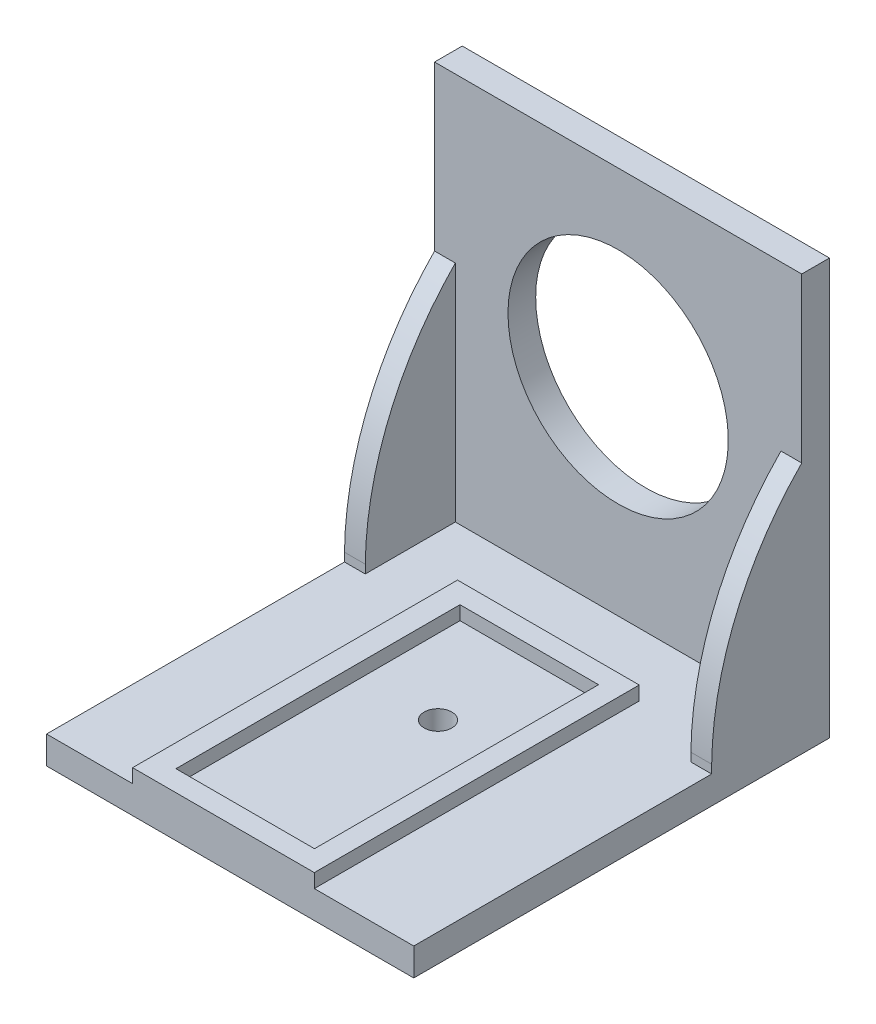
ISO-10303-21;
HEADER;
FILE_DESCRIPTION(('STEP AP214'),'2;1');
FILE_NAME('part.step','',(''),(''),'','','');
FILE_SCHEMA(('AUTOMOTIVE_DESIGN { 1 0 10303 214 1 1 1 1 }'));
ENDSEC;
DATA;
#1=APPLICATION_CONTEXT('core data for automotive mechanical design processes');
#2=APPLICATION_PROTOCOL_DEFINITION('international standard','automotive_design',2000,#1);
#3=PRODUCT_CONTEXT('',#1,'mechanical');
#4=PRODUCT('Part','Part','',(#3));
#5=PRODUCT_RELATED_PRODUCT_CATEGORY('part','',(#4));
#6=PRODUCT_DEFINITION_FORMATION('','',#4);
#7=PRODUCT_DEFINITION_CONTEXT('part definition',#1,'design');
#8=PRODUCT_DEFINITION('design','',#6,#7);
#9=PRODUCT_DEFINITION_SHAPE('','',#8);
#10=(LENGTH_UNIT() NAMED_UNIT(*) SI_UNIT(.MILLI.,.METRE.));
#11=(NAMED_UNIT(*) PLANE_ANGLE_UNIT() SI_UNIT($,.RADIAN.));
#12=(NAMED_UNIT(*) SI_UNIT($,.STERADIAN.) SOLID_ANGLE_UNIT());
#13=UNCERTAINTY_MEASURE_WITH_UNIT(LENGTH_MEASURE(1.E-05),#10,'distance_accuracy_value','');
#14=(GEOMETRIC_REPRESENTATION_CONTEXT(3) GLOBAL_UNCERTAINTY_ASSIGNED_CONTEXT((#13)) GLOBAL_UNIT_ASSIGNED_CONTEXT((#10,
#11,#12)) REPRESENTATION_CONTEXT('',''));
#15=CARTESIAN_POINT('',(0.,0.,0.));
#16=DIRECTION('',(0.,0.,1.));
#17=DIRECTION('',(1.,0.,0.));
#18=AXIS2_PLACEMENT_3D('',#15,#16,#17);
#19=CARTESIAN_POINT('',(0.,4.,60.));
#20=DIRECTION('',(0.,-1.,0.));
#21=DIRECTION('',(0.,0.,-1.));
#22=AXIS2_PLACEMENT_3D('',#19,#20,#21);
#23=PLANE('',#22);
#24=DIRECTION('',(0.,0.,-1.));
#25=VECTOR('',#24,1.);
#26=CARTESIAN_POINT('',(38.6461164607933,4.,60.));
#27=LINE('',#26,#25);
#28=CARTESIAN_POINT('',(38.6461164607933,4.,60.));
#29=VERTEX_POINT('',#28);
#30=CARTESIAN_POINT('',(38.6461164607933,4.,13.1010553588965));
#31=VERTEX_POINT('',#30);
#32=EDGE_CURVE('E252',#29,#31,#27,.T.);
#33=ORIENTED_EDGE('',*,*,#32,.F.);
#34=DIRECTION('',(-1.,0.,0.));
#35=VECTOR('',#34,1.);
#36=CARTESIAN_POINT('',(0.,4.,60.));
#37=LINE('',#36,#35);
#38=CARTESIAN_POINT('',(53.,4.,60.));
#39=VERTEX_POINT('',#38);
#40=EDGE_CURVE('E314',#39,#29,#37,.T.);
#41=ORIENTED_EDGE('',*,*,#40,.F.);
#42=DIRECTION('',(0.,0.,-1.));
#43=VECTOR('',#42,1.);
#44=CARTESIAN_POINT('',(53.,4.,60.));
#45=LINE('',#44,#43);
#46=CARTESIAN_POINT('',(53.,4.,17.));
#47=VERTEX_POINT('',#46);
#48=EDGE_CURVE('E320',#39,#47,#45,.T.);
#49=ORIENTED_EDGE('',*,*,#48,.T.);
#50=DIRECTION('',(1.,0.,0.));
#51=VECTOR('',#50,1.);
#52=CARTESIAN_POINT('',(0.,4.,17.));
#53=LINE('',#52,#51);
#54=CARTESIAN_POINT('',(50.,4.,17.));
#55=VERTEX_POINT('',#54);
#56=EDGE_CURVE('E293',#55,#47,#53,.T.);
#57=ORIENTED_EDGE('',*,*,#56,.F.);
#58=DIRECTION('',(0.,0.,1.));
#59=VECTOR('',#58,1.);
#60=CARTESIAN_POINT('',(50.,4.,60.));
#61=LINE('',#60,#59);
#62=CARTESIAN_POINT('',(50.,4.,4.));
#63=VERTEX_POINT('',#62);
#64=EDGE_CURVE('E287',#63,#55,#61,.T.);
#65=ORIENTED_EDGE('',*,*,#64,.F.);
#66=DIRECTION('',(-1.,0.,0.));
#67=VECTOR('',#66,1.);
#68=CARTESIAN_POINT('',(0.,4.,4.));
#69=LINE('',#68,#67);
#70=CARTESIAN_POINT('',(3.,4.,4.));
#71=VERTEX_POINT('',#70);
#72=EDGE_CURVE('E322',#63,#71,#69,.T.);
#73=ORIENTED_EDGE('',*,*,#72,.T.);
#74=DIRECTION('',(0.,0.,-1.));
#75=VECTOR('',#74,1.);
#76=CARTESIAN_POINT('',(3.,4.,60.));
#77=LINE('',#76,#75);
#78=CARTESIAN_POINT('',(3.,4.,17.));
#79=VERTEX_POINT('',#78);
#80=EDGE_CURVE('E12',#79,#71,#77,.T.);
#81=ORIENTED_EDGE('',*,*,#80,.F.);
#82=DIRECTION('',(-1.,0.,0.));
#83=VECTOR('',#82,1.);
#84=CARTESIAN_POINT('',(0.,4.,17.));
#85=LINE('',#84,#83);
#86=CARTESIAN_POINT('',(0.,4.,17.));
#87=VERTEX_POINT('',#86);
#88=EDGE_CURVE('E66',#79,#87,#85,.T.);
#89=ORIENTED_EDGE('',*,*,#88,.T.);
#90=DIRECTION('',(0.,0.,-1.));
#91=VECTOR('',#90,1.);
#92=CARTESIAN_POINT('',(0.,4.,60.));
#93=LINE('',#92,#91);
#94=CARTESIAN_POINT('',(0.,4.,60.));
#95=VERTEX_POINT('',#94);
#96=EDGE_CURVE('E317',#95,#87,#93,.T.);
#97=ORIENTED_EDGE('',*,*,#96,.F.);
#98=CARTESIAN_POINT('',(12.4175461324136,4.,60.));
#99=VERTEX_POINT('',#98);
#100=EDGE_CURVE('E313',#99,#95,#37,.T.);
#101=ORIENTED_EDGE('',*,*,#100,.F.);
#102=DIRECTION('',(0.,0.,-1.));
#103=VECTOR('',#102,1.);
#104=CARTESIAN_POINT('',(12.4175461324136,4.,60.));
#105=LINE('',#104,#103);
#106=CARTESIAN_POINT('',(12.4175461324136,4.,13.1010553588965));
#107=VERTEX_POINT('',#106);
#108=EDGE_CURVE('E249',#99,#107,#105,.T.);
#109=ORIENTED_EDGE('',*,*,#108,.T.);
#110=DIRECTION('',(1.,0.,0.));
#111=VECTOR('',#110,1.);
#112=CARTESIAN_POINT('',(0.,4.,13.1010553588965));
#113=LINE('',#112,#111);
#114=EDGE_CURVE('E262',#107,#31,#113,.T.);
#115=ORIENTED_EDGE('',*,*,#114,.T.);
#116=EDGE_LOOP('',(#33,#41,#49,#57,#65,#73,#81,#89,#97,#101,#109,#115));
#117=FACE_BOUND('',#116,.T.);
#118=ADVANCED_FACE('F57',(#117),#23,.F.);
#119=CARTESIAN_POINT('',(0.,0.,4.));
#120=DIRECTION('',(0.,0.,-1.));
#121=DIRECTION('',(-1.,0.,0.));
#122=AXIS2_PLACEMENT_3D('',#119,#120,#121);
#123=PLANE('',#122);
#124=CARTESIAN_POINT('',(26.5,33.9,4.));
#125=DIRECTION('',(0.,0.,-1.));
#126=DIRECTION('',(-1.,0.,0.));
#127=AXIS2_PLACEMENT_3D('',#124,#125,#126);
#128=CIRCLE('',#127,15.9);
#129=CARTESIAN_POINT('',(10.6,33.9,4.));
#130=VERTEX_POINT('',#129);
#131=EDGE_CURVE('E354',#130,#130,#128,.T.);
#132=ORIENTED_EDGE('',*,*,#131,.T.);
#133=EDGE_LOOP('',(#132));
#134=FACE_BOUND('',#133,.T.);
#135=DIRECTION('',(0.,-1.,0.));
#136=VECTOR('',#135,1.);
#137=CARTESIAN_POINT('',(50.,0.,4.));
#138=LINE('',#137,#136);
#139=CARTESIAN_POINT('',(50.,36.3738538523669,4.));
#140=VERTEX_POINT('',#139);
#141=EDGE_CURVE('E290',#140,#63,#138,.T.);
#142=ORIENTED_EDGE('',*,*,#141,.F.);
#143=DIRECTION('',(-1.,0.,0.));
#144=VECTOR('',#143,1.);
#145=CARTESIAN_POINT('',(0.,36.3738538523669,4.));
#146=LINE('',#145,#144);
#147=CARTESIAN_POINT('',(53.,36.3738538523669,4.));
#148=VERTEX_POINT('',#147);
#149=EDGE_CURVE('E285',#148,#140,#146,.T.);
#150=ORIENTED_EDGE('',*,*,#149,.F.);
#151=DIRECTION('',(0.,1.,0.));
#152=VECTOR('',#151,1.);
#153=CARTESIAN_POINT('',(53.,0.,4.));
#154=LINE('',#153,#152);
#155=CARTESIAN_POINT('',(53.,60.,4.));
#156=VERTEX_POINT('',#155);
#157=EDGE_CURVE('E328',#148,#156,#154,.T.);
#158=ORIENTED_EDGE('',*,*,#157,.T.);
#159=DIRECTION('',(-1.,0.,0.));
#160=VECTOR('',#159,1.);
#161=CARTESIAN_POINT('',(0.,60.,4.));
#162=LINE('',#161,#160);
#163=CARTESIAN_POINT('',(0.,60.,4.));
#164=VERTEX_POINT('',#163);
#165=EDGE_CURVE('E331',#156,#164,#162,.T.);
#166=ORIENTED_EDGE('',*,*,#165,.T.);
#167=DIRECTION('',(0.,-1.,0.));
#168=VECTOR('',#167,1.);
#169=CARTESIAN_POINT('',(0.,0.,4.));
#170=LINE('',#169,#168);
#171=CARTESIAN_POINT('',(0.,36.3738538523669,4.));
#172=VERTEX_POINT('',#171);
#173=EDGE_CURVE('E325',#164,#172,#170,.T.);
#174=ORIENTED_EDGE('',*,*,#173,.T.);
#175=DIRECTION('',(-1.,0.,0.));
#176=VECTOR('',#175,1.);
#177=CARTESIAN_POINT('',(0.,36.3738538523669,4.));
#178=LINE('',#177,#176);
#179=CARTESIAN_POINT('',(3.00000000000001,36.3738538523669,4.));
#180=VERTEX_POINT('',#179);
#181=EDGE_CURVE('E304',#180,#172,#178,.T.);
#182=ORIENTED_EDGE('',*,*,#181,.F.);
#183=DIRECTION('',(0.,1.,0.));
#184=VECTOR('',#183,1.);
#185=CARTESIAN_POINT('',(3.,0.,4.));
#186=LINE('',#185,#184);
#187=EDGE_CURVE('E301',#71,#180,#186,.T.);
#188=ORIENTED_EDGE('',*,*,#187,.F.);
#189=ORIENTED_EDGE('',*,*,#72,.F.);
#190=EDGE_LOOP('',(#142,#150,#158,#166,#174,#182,#188,#189));
#191=FACE_BOUND('',#190,.T.);
#192=ADVANCED_FACE('F390',(#134,#191),#123,.F.);
#193=CARTESIAN_POINT('',(0.,0.,4.));
#194=DIRECTION('',(1.,0.,0.));
#195=DIRECTION('',(0.,1.,0.));
#196=AXIS2_PLACEMENT_3D('',#193,#194,#195);
#197=PLANE('',#196);
#198=DIRECTION('',(0.,-1.,0.));
#199=VECTOR('',#198,1.);
#200=CARTESIAN_POINT('',(0.,36.3738538523669,17.));
#201=LINE('',#200,#199);
#202=CARTESIAN_POINT('',(0.,5.22659799611902,17.));
#203=VERTEX_POINT('',#202);
#204=EDGE_CURVE('E296',#203,#87,#201,.T.);
#205=ORIENTED_EDGE('',*,*,#204,.F.);
#206=CARTESIAN_POINT('',(0.,4.61329899805943,-28.2829503458636));
#207=DIRECTION('',(1.,0.,0.));
#208=DIRECTION('',(0.,1.,0.));
#209=AXIS2_PLACEMENT_3D('',#206,#207,#208);
#210=CIRCLE('',#209,45.2871033263);
#211=EDGE_CURVE('E277',#203,#172,#210,.F.);
#212=ORIENTED_EDGE('',*,*,#211,.T.);
#213=ORIENTED_EDGE('',*,*,#173,.F.);
#214=DIRECTION('',(0.,0.,-1.));
#215=VECTOR('',#214,1.);
#216=CARTESIAN_POINT('',(0.,60.,4.));
#217=LINE('',#216,#215);
#218=CARTESIAN_POINT('',(0.,60.,0.));
#219=VERTEX_POINT('',#218);
#220=EDGE_CURVE('E333',#164,#219,#217,.T.);
#221=ORIENTED_EDGE('',*,*,#220,.T.);
#222=DIRECTION('',(0.,-1.,0.));
#223=VECTOR('',#222,1.);
#224=CARTESIAN_POINT('',(0.,0.,0.));
#225=LINE('',#224,#223);
#226=CARTESIAN_POINT('',(0.,0.,0.));
#227=VERTEX_POINT('',#226);
#228=EDGE_CURVE('E324',#219,#227,#225,.T.);
#229=ORIENTED_EDGE('',*,*,#228,.T.);
#230=DIRECTION('',(0.,0.,-1.));
#231=VECTOR('',#230,1.);
#232=CARTESIAN_POINT('',(0.,0.,4.));
#233=LINE('',#232,#231);
#234=CARTESIAN_POINT('',(0.,0.,60.));
#235=VERTEX_POINT('',#234);
#236=EDGE_CURVE('E349',#235,#227,#233,.T.);
#237=ORIENTED_EDGE('',*,*,#236,.F.);
#238=DIRECTION('',(0.,-1.,0.));
#239=VECTOR('',#238,1.);
#240=CARTESIAN_POINT('',(0.,0.,60.));
#241=LINE('',#240,#239);
#242=EDGE_CURVE('E306',#95,#235,#241,.T.);
#243=ORIENTED_EDGE('',*,*,#242,.F.);
#244=ORIENTED_EDGE('',*,*,#96,.T.);
#245=EDGE_LOOP('',(#205,#212,#213,#221,#229,#237,#243,#244));
#246=FACE_BOUND('',#245,.T.);
#247=ADVANCED_FACE('F59',(#246),#197,.F.);
#248=CARTESIAN_POINT('',(0.,0.,4.));
#249=DIRECTION('',(0.,1.,0.));
#250=DIRECTION('',(0.,0.,1.));
#251=AXIS2_PLACEMENT_3D('',#248,#249,#250);
#252=PLANE('',#251);
#253=CARTESIAN_POINT('',(26.5,0.,30.));
#254=DIRECTION('',(0.,1.,0.));
#255=DIRECTION('',(0.,0.,1.));
#256=AXIS2_PLACEMENT_3D('',#253,#254,#255);
#257=CIRCLE('',#256,2.);
#258=CARTESIAN_POINT('',(26.5,0.,32.));
#259=VERTEX_POINT('',#258);
#260=EDGE_CURVE('E207',#259,#259,#257,.T.);
#261=ORIENTED_EDGE('',*,*,#260,.T.);
#262=EDGE_LOOP('',(#261));
#263=FACE_BOUND('',#262,.T.);
#264=DIRECTION('',(0.,0.,-1.));
#265=VECTOR('',#264,1.);
#266=CARTESIAN_POINT('',(53.,0.,4.));
#267=LINE('',#266,#265);
#268=CARTESIAN_POINT('',(53.,0.,60.));
#269=VERTEX_POINT('',#268);
#270=CARTESIAN_POINT('',(53.,0.,0.));
#271=VERTEX_POINT('',#270);
#272=EDGE_CURVE('E347',#269,#271,#267,.T.);
#273=ORIENTED_EDGE('',*,*,#272,.F.);
#274=DIRECTION('',(1.,0.,0.));
#275=VECTOR('',#274,1.);
#276=CARTESIAN_POINT('',(0.,0.,60.));
#277=LINE('',#276,#275);
#278=EDGE_CURVE('E309',#235,#269,#277,.T.);
#279=ORIENTED_EDGE('',*,*,#278,.F.);
#280=ORIENTED_EDGE('',*,*,#236,.T.);
#281=DIRECTION('',(1.,0.,0.));
#282=VECTOR('',#281,1.);
#283=CARTESIAN_POINT('',(0.,0.,0.));
#284=LINE('',#283,#282);
#285=EDGE_CURVE('E336',#227,#271,#284,.T.);
#286=ORIENTED_EDGE('',*,*,#285,.T.);
#287=EDGE_LOOP('',(#273,#279,#280,#286));
#288=FACE_BOUND('',#287,.T.);
#289=ADVANCED_FACE('F605',(#263,#288),#252,.F.);
#290=CARTESIAN_POINT('',(53.,0.,4.));
#291=DIRECTION('',(-1.,0.,0.));
#292=DIRECTION('',(0.,-1.,0.));
#293=AXIS2_PLACEMENT_3D('',#290,#291,#292);
#294=PLANE('',#293);
#295=ORIENTED_EDGE('',*,*,#157,.F.);
#296=CARTESIAN_POINT('',(53.,4.61329899805943,-28.2829503458636));
#297=DIRECTION('',(-1.,0.,0.));
#298=DIRECTION('',(0.,-1.,0.));
#299=AXIS2_PLACEMENT_3D('',#296,#297,#298);
#300=CIRCLE('',#299,45.2871033263);
#301=CARTESIAN_POINT('',(53.,5.22659799611902,17.));
#302=VERTEX_POINT('',#301);
#303=EDGE_CURVE('E274',#148,#302,#300,.F.);
#304=ORIENTED_EDGE('',*,*,#303,.T.);
#305=DIRECTION('',(0.,1.,0.));
#306=VECTOR('',#305,1.);
#307=CARTESIAN_POINT('',(53.,36.3738538523669,17.));
#308=LINE('',#307,#306);
#309=EDGE_CURVE('E282',#47,#302,#308,.T.);
#310=ORIENTED_EDGE('',*,*,#309,.F.);
#311=ORIENTED_EDGE('',*,*,#48,.F.);
#312=DIRECTION('',(0.,1.,0.));
#313=VECTOR('',#312,1.);
#314=CARTESIAN_POINT('',(53.,0.,60.));
#315=LINE('',#314,#313);
#316=EDGE_CURVE('E311',#269,#39,#315,.T.);
#317=ORIENTED_EDGE('',*,*,#316,.F.);
#318=ORIENTED_EDGE('',*,*,#272,.T.);
#319=DIRECTION('',(0.,1.,0.));
#320=VECTOR('',#319,1.);
#321=CARTESIAN_POINT('',(53.,0.,0.));
#322=LINE('',#321,#320);
#323=CARTESIAN_POINT('',(53.,60.,0.));
#324=VERTEX_POINT('',#323);
#325=EDGE_CURVE('E339',#271,#324,#322,.T.);
#326=ORIENTED_EDGE('',*,*,#325,.T.);
#327=DIRECTION('',(0.,0.,-1.));
#328=VECTOR('',#327,1.);
#329=CARTESIAN_POINT('',(53.,60.,4.));
#330=LINE('',#329,#328);
#331=EDGE_CURVE('E344',#156,#324,#330,.T.);
#332=ORIENTED_EDGE('',*,*,#331,.F.);
#333=EDGE_LOOP('',(#295,#304,#310,#311,#317,#318,#326,#332));
#334=FACE_BOUND('',#333,.T.);
#335=ADVANCED_FACE('F381',(#334),#294,.F.);
#336=CARTESIAN_POINT('',(0.,60.,4.));
#337=DIRECTION('',(0.,-1.,0.));
#338=DIRECTION('',(0.,0.,-1.));
#339=AXIS2_PLACEMENT_3D('',#336,#337,#338);
#340=PLANE('',#339);
#341=DIRECTION('',(-1.,0.,0.));
#342=VECTOR('',#341,1.);
#343=CARTESIAN_POINT('',(0.,60.,0.));
#344=LINE('',#343,#342);
#345=EDGE_CURVE('E329',#324,#219,#344,.T.);
#346=ORIENTED_EDGE('',*,*,#345,.T.);
#347=ORIENTED_EDGE('',*,*,#220,.F.);
#348=ORIENTED_EDGE('',*,*,#165,.F.);
#349=ORIENTED_EDGE('',*,*,#331,.T.);
#350=EDGE_LOOP('',(#346,#347,#348,#349));
#351=FACE_BOUND('',#350,.T.);
#352=ADVANCED_FACE('F372',(#351),#340,.F.);
#353=CARTESIAN_POINT('',(0.,0.,0.));
#354=DIRECTION('',(0.,0.,-1.));
#355=DIRECTION('',(-1.,0.,0.));
#356=AXIS2_PLACEMENT_3D('',#353,#354,#355);
#357=PLANE('',#356);
#358=CARTESIAN_POINT('',(26.5,33.9,0.));
#359=DIRECTION('',(0.,0.,-1.));
#360=DIRECTION('',(-1.,0.,0.));
#361=AXIS2_PLACEMENT_3D('',#358,#359,#360);
#362=CIRCLE('',#361,15.9);
#363=CARTESIAN_POINT('',(10.6,33.9,0.));
#364=VERTEX_POINT('',#363);
#365=EDGE_CURVE('E61',#364,#364,#362,.T.);
#366=ORIENTED_EDGE('',*,*,#365,.F.);
#367=EDGE_LOOP('',(#366));
#368=FACE_BOUND('',#367,.T.);
#369=ORIENTED_EDGE('',*,*,#325,.F.);
#370=ORIENTED_EDGE('',*,*,#285,.F.);
#371=ORIENTED_EDGE('',*,*,#228,.F.);
#372=ORIENTED_EDGE('',*,*,#345,.F.);
#373=EDGE_LOOP('',(#369,#370,#371,#372));
#374=FACE_BOUND('',#373,.T.);
#375=ADVANCED_FACE('F368',(#368,#374),#357,.T.);
#376=CARTESIAN_POINT('',(0.,0.,60.));
#377=DIRECTION('',(0.,0.,-1.));
#378=DIRECTION('',(-1.,0.,0.));
#379=AXIS2_PLACEMENT_3D('',#376,#377,#378);
#380=PLANE('',#379);
#381=ORIENTED_EDGE('',*,*,#278,.T.);
#382=ORIENTED_EDGE('',*,*,#316,.T.);
#383=ORIENTED_EDGE('',*,*,#40,.T.);
#384=DIRECTION('',(0.,-1.,0.));
#385=VECTOR('',#384,1.);
#386=CARTESIAN_POINT('',(38.6461164607933,6.,60.));
#387=LINE('',#386,#385);
#388=CARTESIAN_POINT('',(38.6461164607933,6.,60.));
#389=VERTEX_POINT('',#388);
#390=EDGE_CURVE('E247',#389,#29,#387,.T.);
#391=ORIENTED_EDGE('',*,*,#390,.F.);
#392=DIRECTION('',(1.,0.,0.));
#393=VECTOR('',#392,1.);
#394=CARTESIAN_POINT('',(12.4175461324136,6.,60.));
#395=LINE('',#394,#393);
#396=CARTESIAN_POINT('',(12.4175461324136,6.,60.));
#397=VERTEX_POINT('',#396);
#398=EDGE_CURVE('E214',#397,#389,#395,.T.);
#399=ORIENTED_EDGE('',*,*,#398,.F.);
#400=DIRECTION('',(0.,-1.,0.));
#401=VECTOR('',#400,1.);
#402=CARTESIAN_POINT('',(12.4175461324136,6.,60.));
#403=LINE('',#402,#401);
#404=EDGE_CURVE('E240',#397,#99,#403,.T.);
#405=ORIENTED_EDGE('',*,*,#404,.T.);
#406=ORIENTED_EDGE('',*,*,#100,.T.);
#407=ORIENTED_EDGE('',*,*,#242,.T.);
#408=EDGE_LOOP('',(#381,#382,#383,#391,#399,#405,#406,#407));
#409=FACE_BOUND('',#408,.T.);
#410=ADVANCED_FACE('F371',(#409),#380,.F.);
#411=CARTESIAN_POINT('',(3.,36.3738538523669,17.));
#412=DIRECTION('',(-1.,0.,0.));
#413=DIRECTION('',(0.,-1.,0.));
#414=AXIS2_PLACEMENT_3D('',#411,#412,#413);
#415=PLANE('',#414);
#416=ORIENTED_EDGE('',*,*,#187,.T.);
#417=CARTESIAN_POINT('',(3.,4.61329899805943,-28.2829503458636));
#418=DIRECTION('',(-1.,0.,0.));
#419=DIRECTION('',(0.,-1.,0.));
#420=AXIS2_PLACEMENT_3D('',#417,#418,#419);
#421=CIRCLE('',#420,45.2871033263);
#422=CARTESIAN_POINT('',(3.,5.22659799611902,17.));
#423=VERTEX_POINT('',#422);
#424=EDGE_CURVE('E271',#180,#423,#421,.F.);
#425=ORIENTED_EDGE('',*,*,#424,.T.);
#426=DIRECTION('',(0.,1.,0.));
#427=VECTOR('',#426,1.);
#428=CARTESIAN_POINT('',(3.,36.3738538523669,17.));
#429=LINE('',#428,#427);
#430=EDGE_CURVE('E298',#79,#423,#429,.T.);
#431=ORIENTED_EDGE('',*,*,#430,.F.);
#432=ORIENTED_EDGE('',*,*,#80,.T.);
#433=EDGE_LOOP('',(#416,#425,#431,#432));
#434=FACE_BOUND('',#433,.T.);
#435=ADVANCED_FACE('F411',(#434),#415,.F.);
#436=CARTESIAN_POINT('',(0.,0.,17.));
#437=DIRECTION('',(0.,0.,1.));
#438=DIRECTION('',(1.,0.,0.));
#439=AXIS2_PLACEMENT_3D('',#436,#437,#438);
#440=PLANE('',#439);
#441=DIRECTION('',(1.,0.,0.));
#442=VECTOR('',#441,1.);
#443=CARTESIAN_POINT('',(-15.,5.22659799611901,17.));
#444=LINE('',#443,#442);
#445=EDGE_CURVE('E267',#203,#423,#444,.T.);
#446=ORIENTED_EDGE('',*,*,#445,.F.);
#447=ORIENTED_EDGE('',*,*,#204,.T.);
#448=ORIENTED_EDGE('',*,*,#88,.F.);
#449=ORIENTED_EDGE('',*,*,#430,.T.);
#450=EDGE_LOOP('',(#446,#447,#448,#449));
#451=FACE_BOUND('',#450,.T.);
#452=ADVANCED_FACE('F414',(#451),#440,.T.);
#453=CARTESIAN_POINT('',(0.,0.,17.));
#454=DIRECTION('',(0.,0.,-1.));
#455=DIRECTION('',(-1.,0.,0.));
#456=AXIS2_PLACEMENT_3D('',#453,#454,#455);
#457=PLANE('',#456);
#458=ORIENTED_EDGE('',*,*,#309,.T.);
#459=CARTESIAN_POINT('',(50.,5.22659799611902,17.));
#460=VERTEX_POINT('',#459);
#461=EDGE_CURVE('E265',#460,#302,#444,.T.);
#462=ORIENTED_EDGE('',*,*,#461,.F.);
#463=DIRECTION('',(0.,-1.,0.));
#464=VECTOR('',#463,1.);
#465=CARTESIAN_POINT('',(50.,36.3738538523669,17.));
#466=LINE('',#465,#464);
#467=EDGE_CURVE('E280',#460,#55,#466,.T.);
#468=ORIENTED_EDGE('',*,*,#467,.T.);
#469=ORIENTED_EDGE('',*,*,#56,.T.);
#470=EDGE_LOOP('',(#458,#462,#468,#469));
#471=FACE_BOUND('',#470,.T.);
#472=ADVANCED_FACE('F398',(#471),#457,.F.);
#473=CARTESIAN_POINT('',(50.,36.3738538523669,17.));
#474=DIRECTION('',(1.,0.,0.));
#475=DIRECTION('',(0.,1.,0.));
#476=AXIS2_PLACEMENT_3D('',#473,#474,#475);
#477=PLANE('',#476);
#478=ORIENTED_EDGE('',*,*,#467,.F.);
#479=CARTESIAN_POINT('',(50.,4.61329899805943,-28.2829503458636));
#480=DIRECTION('',(1.,0.,0.));
#481=DIRECTION('',(0.,1.,0.));
#482=AXIS2_PLACEMENT_3D('',#479,#480,#481);
#483=CIRCLE('',#482,45.2871033263);
#484=EDGE_CURVE('E268',#460,#140,#483,.F.);
#485=ORIENTED_EDGE('',*,*,#484,.T.);
#486=ORIENTED_EDGE('',*,*,#141,.T.);
#487=ORIENTED_EDGE('',*,*,#64,.T.);
#488=EDGE_LOOP('',(#478,#485,#486,#487));
#489=FACE_BOUND('',#488,.T.);
#490=ADVANCED_FACE('F406',(#489),#477,.F.);
#491=CARTESIAN_POINT('',(-15.,4.61329899805943,-28.2829503458636));
#492=DIRECTION('',(1.,0.,0.));
#493=DIRECTION('',(0.,1.,0.));
#494=AXIS2_PLACEMENT_3D('',#491,#492,#493);
#495=CYLINDRICAL_SURFACE('',#494,45.2871033263);
#496=ORIENTED_EDGE('',*,*,#149,.T.);
#497=ORIENTED_EDGE('',*,*,#484,.F.);
#498=ORIENTED_EDGE('',*,*,#461,.T.);
#499=ORIENTED_EDGE('',*,*,#303,.F.);
#500=EDGE_LOOP('',(#496,#497,#498,#499));
#501=FACE_BOUND('',#500,.T.);
#502=ADVANCED_FACE('F478',(#501),#495,.T.);
#503=ORIENTED_EDGE('',*,*,#445,.T.);
#504=ORIENTED_EDGE('',*,*,#424,.F.);
#505=ORIENTED_EDGE('',*,*,#181,.T.);
#506=ORIENTED_EDGE('',*,*,#211,.F.);
#507=EDGE_LOOP('',(#503,#504,#505,#506));
#508=FACE_BOUND('',#507,.T.);
#509=ADVANCED_FACE('F474',(#508),#495,.T.);
#510=CARTESIAN_POINT('',(12.4175461324136,6.,13.1010553588965));
#511=DIRECTION('',(0.,0.,-1.));
#512=DIRECTION('',(-1.,0.,0.));
#513=AXIS2_PLACEMENT_3D('',#510,#511,#512);
#514=PLANE('',#513);
#515=ORIENTED_EDGE('',*,*,#114,.F.);
#516=DIRECTION('',(0.,-1.,0.));
#517=VECTOR('',#516,1.);
#518=CARTESIAN_POINT('',(12.4175461324136,6.,13.1010553588965));
#519=LINE('',#518,#517);
#520=CARTESIAN_POINT('',(12.4175461324136,6.,13.1010553588965));
#521=VERTEX_POINT('',#520);
#522=EDGE_CURVE('E74',#521,#107,#519,.T.);
#523=ORIENTED_EDGE('',*,*,#522,.F.);
#524=DIRECTION('',(1.,0.,0.));
#525=VECTOR('',#524,1.);
#526=CARTESIAN_POINT('',(12.4175461324136,6.,13.1010553588965));
#527=LINE('',#526,#525);
#528=CARTESIAN_POINT('',(38.6461164607933,6.,13.1010553588965));
#529=VERTEX_POINT('',#528);
#530=EDGE_CURVE('E235',#521,#529,#527,.T.);
#531=ORIENTED_EDGE('',*,*,#530,.T.);
#532=DIRECTION('',(0.,-1.,0.));
#533=VECTOR('',#532,1.);
#534=CARTESIAN_POINT('',(38.6461164607933,6.,13.1010553588965));
#535=LINE('',#534,#533);
#536=EDGE_CURVE('E244',#529,#31,#535,.T.);
#537=ORIENTED_EDGE('',*,*,#536,.T.);
#538=EDGE_LOOP('',(#515,#523,#531,#537));
#539=FACE_BOUND('',#538,.T.);
#540=ADVANCED_FACE('F430',(#539),#514,.T.);
#541=CARTESIAN_POINT('',(15.6741135892929,6.,57.));
#542=DIRECTION('',(0.,0.,-1.));
#543=DIRECTION('',(-1.,0.,0.));
#544=AXIS2_PLACEMENT_3D('',#541,#542,#543);
#545=PLANE('',#544);
#546=DIRECTION('',(1.,0.,0.));
#547=VECTOR('',#546,1.);
#548=CARTESIAN_POINT('',(0.,4.,57.));
#549=LINE('',#548,#547);
#550=CARTESIAN_POINT('',(15.6741135892929,4.,57.));
#551=VERTEX_POINT('',#550);
#552=CARTESIAN_POINT('',(35.6741135892929,4.,57.));
#553=VERTEX_POINT('',#552);
#554=EDGE_CURVE('E82',#551,#553,#549,.T.);
#555=ORIENTED_EDGE('',*,*,#554,.F.);
#556=DIRECTION('',(0.,-1.,0.));
#557=VECTOR('',#556,1.);
#558=CARTESIAN_POINT('',(15.6741135892929,6.,57.));
#559=LINE('',#558,#557);
#560=CARTESIAN_POINT('',(15.6741135892929,6.,57.));
#561=VERTEX_POINT('',#560);
#562=EDGE_CURVE('E201',#561,#551,#559,.T.);
#563=ORIENTED_EDGE('',*,*,#562,.F.);
#564=DIRECTION('',(1.,0.,0.));
#565=VECTOR('',#564,1.);
#566=CARTESIAN_POINT('',(15.6741135892929,6.,57.));
#567=LINE('',#566,#565);
#568=CARTESIAN_POINT('',(35.6741135892929,6.,57.));
#569=VERTEX_POINT('',#568);
#570=EDGE_CURVE('E196',#561,#569,#567,.T.);
#571=ORIENTED_EDGE('',*,*,#570,.T.);
#572=DIRECTION('',(0.,-1.,0.));
#573=VECTOR('',#572,1.);
#574=CARTESIAN_POINT('',(35.6741135892929,6.,57.));
#575=LINE('',#574,#573);
#576=EDGE_CURVE('E199',#569,#553,#575,.T.);
#577=ORIENTED_EDGE('',*,*,#576,.T.);
#578=EDGE_LOOP('',(#555,#563,#571,#577));
#579=FACE_BOUND('',#578,.T.);
#580=ADVANCED_FACE('F198',(#579),#545,.T.);
#581=CARTESIAN_POINT('',(35.6741135892929,6.,57.));
#582=DIRECTION('',(-1.,0.,0.));
#583=DIRECTION('',(0.,0.,1.));
#584=AXIS2_PLACEMENT_3D('',#581,#582,#583);
#585=PLANE('',#584);
#586=DIRECTION('',(0.,0.,-1.));
#587=VECTOR('',#586,1.);
#588=CARTESIAN_POINT('',(35.6741135892929,4.,60.));
#589=LINE('',#588,#587);
#590=CARTESIAN_POINT('',(35.6741135892929,4.,16.));
#591=VERTEX_POINT('',#590);
#592=EDGE_CURVE('E213',#553,#591,#589,.T.);
#593=ORIENTED_EDGE('',*,*,#592,.F.);
#594=ORIENTED_EDGE('',*,*,#576,.F.);
#595=DIRECTION('',(0.,0.,-1.));
#596=VECTOR('',#595,1.);
#597=CARTESIAN_POINT('',(35.6741135892929,6.,57.));
#598=LINE('',#597,#596);
#599=CARTESIAN_POINT('',(35.6741135892929,6.,16.));
#600=VERTEX_POINT('',#599);
#601=EDGE_CURVE('E206',#569,#600,#598,.T.);
#602=ORIENTED_EDGE('',*,*,#601,.T.);
#603=DIRECTION('',(0.,-1.,0.));
#604=VECTOR('',#603,1.);
#605=CARTESIAN_POINT('',(35.6741135892929,6.,16.));
#606=LINE('',#605,#604);
#607=EDGE_CURVE('E215',#600,#591,#606,.T.);
#608=ORIENTED_EDGE('',*,*,#607,.T.);
#609=EDGE_LOOP('',(#593,#594,#602,#608));
#610=FACE_BOUND('',#609,.T.);
#611=ADVANCED_FACE('F210',(#610),#585,.T.);
#612=CARTESIAN_POINT('',(15.6741135892929,6.,16.));
#613=DIRECTION('',(0.,0.,-1.));
#614=DIRECTION('',(-1.,0.,0.));
#615=AXIS2_PLACEMENT_3D('',#612,#613,#614);
#616=PLANE('',#615);
#617=DIRECTION('',(0.,-1.,0.));
#618=VECTOR('',#617,1.);
#619=CARTESIAN_POINT('',(15.6741135892929,6.,16.));
#620=LINE('',#619,#618);
#621=CARTESIAN_POINT('',(15.6741135892929,6.,16.));
#622=VERTEX_POINT('',#621);
#623=CARTESIAN_POINT('',(15.6741135892929,4.,16.));
#624=VERTEX_POINT('',#623);
#625=EDGE_CURVE('E227',#622,#624,#620,.T.);
#626=ORIENTED_EDGE('',*,*,#625,.T.);
#627=DIRECTION('',(1.,0.,0.));
#628=VECTOR('',#627,1.);
#629=CARTESIAN_POINT('',(0.,4.,16.));
#630=LINE('',#629,#628);
#631=EDGE_CURVE('E257',#624,#591,#630,.T.);
#632=ORIENTED_EDGE('',*,*,#631,.T.);
#633=ORIENTED_EDGE('',*,*,#607,.F.);
#634=DIRECTION('',(1.,0.,0.));
#635=VECTOR('',#634,1.);
#636=CARTESIAN_POINT('',(15.6741135892929,6.,16.));
#637=LINE('',#636,#635);
#638=EDGE_CURVE('E219',#622,#600,#637,.T.);
#639=ORIENTED_EDGE('',*,*,#638,.F.);
#640=EDGE_LOOP('',(#626,#632,#633,#639));
#641=FACE_BOUND('',#640,.T.);
#642=ADVANCED_FACE('F441',(#641),#616,.F.);
#643=CARTESIAN_POINT('',(15.6741135892929,6.,57.));
#644=DIRECTION('',(-1.,0.,0.));
#645=DIRECTION('',(0.,0.,1.));
#646=AXIS2_PLACEMENT_3D('',#643,#644,#645);
#647=PLANE('',#646);
#648=ORIENTED_EDGE('',*,*,#562,.T.);
#649=DIRECTION('',(0.,0.,-1.));
#650=VECTOR('',#649,1.);
#651=CARTESIAN_POINT('',(15.6741135892929,4.,60.));
#652=LINE('',#651,#650);
#653=EDGE_CURVE('E254',#551,#624,#652,.T.);
#654=ORIENTED_EDGE('',*,*,#653,.T.);
#655=ORIENTED_EDGE('',*,*,#625,.F.);
#656=DIRECTION('',(0.,0.,-1.));
#657=VECTOR('',#656,1.);
#658=CARTESIAN_POINT('',(15.6741135892929,6.,57.));
#659=LINE('',#658,#657);
#660=EDGE_CURVE('E221',#561,#622,#659,.T.);
#661=ORIENTED_EDGE('',*,*,#660,.F.);
#662=EDGE_LOOP('',(#648,#654,#655,#661));
#663=FACE_BOUND('',#662,.T.);
#664=ADVANCED_FACE('F434',(#663),#647,.F.);
#665=CARTESIAN_POINT('',(38.6461164607933,6.,60.));
#666=DIRECTION('',(-1.,0.,0.));
#667=DIRECTION('',(0.,0.,1.));
#668=AXIS2_PLACEMENT_3D('',#665,#666,#667);
#669=PLANE('',#668);
#670=ORIENTED_EDGE('',*,*,#390,.T.);
#671=ORIENTED_EDGE('',*,*,#32,.T.);
#672=ORIENTED_EDGE('',*,*,#536,.F.);
#673=DIRECTION('',(0.,0.,-1.));
#674=VECTOR('',#673,1.);
#675=CARTESIAN_POINT('',(38.6461164607933,6.,60.));
#676=LINE('',#675,#674);
#677=EDGE_CURVE('E233',#389,#529,#676,.T.);
#678=ORIENTED_EDGE('',*,*,#677,.F.);
#679=EDGE_LOOP('',(#670,#671,#672,#678));
#680=FACE_BOUND('',#679,.T.);
#681=ADVANCED_FACE('F432',(#680),#669,.F.);
#682=CARTESIAN_POINT('',(12.4175461324136,6.,60.));
#683=DIRECTION('',(-1.,0.,0.));
#684=DIRECTION('',(0.,0.,1.));
#685=AXIS2_PLACEMENT_3D('',#682,#683,#684);
#686=PLANE('',#685);
#687=ORIENTED_EDGE('',*,*,#108,.F.);
#688=ORIENTED_EDGE('',*,*,#404,.F.);
#689=DIRECTION('',(0.,0.,-1.));
#690=VECTOR('',#689,1.);
#691=CARTESIAN_POINT('',(12.4175461324136,6.,60.));
#692=LINE('',#691,#690);
#693=EDGE_CURVE('E238',#397,#521,#692,.T.);
#694=ORIENTED_EDGE('',*,*,#693,.T.);
#695=ORIENTED_EDGE('',*,*,#522,.T.);
#696=EDGE_LOOP('',(#687,#688,#694,#695));
#697=FACE_BOUND('',#696,.T.);
#698=ADVANCED_FACE('F423',(#697),#686,.T.);
#699=CARTESIAN_POINT('',(0.,6.,0.));
#700=DIRECTION('',(0.,1.,0.));
#701=DIRECTION('',(0.,0.,1.));
#702=AXIS2_PLACEMENT_3D('',#699,#700,#701);
#703=PLANE('',#702);
#704=ORIENTED_EDGE('',*,*,#398,.T.);
#705=ORIENTED_EDGE('',*,*,#677,.T.);
#706=ORIENTED_EDGE('',*,*,#530,.F.);
#707=ORIENTED_EDGE('',*,*,#693,.F.);
#708=EDGE_LOOP('',(#704,#705,#706,#707));
#709=FACE_BOUND('',#708,.T.);
#710=ORIENTED_EDGE('',*,*,#601,.F.);
#711=ORIENTED_EDGE('',*,*,#570,.F.);
#712=ORIENTED_EDGE('',*,*,#660,.T.);
#713=ORIENTED_EDGE('',*,*,#638,.T.);
#714=EDGE_LOOP('',(#710,#711,#712,#713));
#715=FACE_BOUND('',#714,.T.);
#716=ADVANCED_FACE('F218',(#709,#715),#703,.T.);
#717=CARTESIAN_POINT('',(26.5,4.,30.));
#718=DIRECTION('',(0.,-1.,0.));
#719=DIRECTION('',(0.,0.,-1.));
#720=AXIS2_PLACEMENT_3D('',#717,#718,#719);
#721=CIRCLE('',#720,2.);
#722=CARTESIAN_POINT('',(26.5,4.,28.));
#723=VERTEX_POINT('',#722);
#724=EDGE_CURVE('E352',#723,#723,#721,.T.);
#725=ORIENTED_EDGE('',*,*,#724,.T.);
#726=EDGE_LOOP('',(#725));
#727=FACE_BOUND('',#726,.T.);
#728=ORIENTED_EDGE('',*,*,#653,.F.);
#729=ORIENTED_EDGE('',*,*,#554,.T.);
#730=ORIENTED_EDGE('',*,*,#592,.T.);
#731=ORIENTED_EDGE('',*,*,#631,.F.);
#732=EDGE_LOOP('',(#728,#729,#730,#731));
#733=FACE_BOUND('',#732,.T.);
#734=ADVANCED_FACE('F448',(#727,#733),#23,.F.);
#735=CARTESIAN_POINT('',(26.5,-21.,30.));
#736=DIRECTION('',(0.,1.,0.));
#737=DIRECTION('',(0.,0.,1.));
#738=AXIS2_PLACEMENT_3D('',#735,#736,#737);
#739=CYLINDRICAL_SURFACE('',#738,2.);
#740=ORIENTED_EDGE('',*,*,#724,.F.);
#741=EDGE_LOOP('',(#740));
#742=FACE_BOUND('',#741,.T.);
#743=ORIENTED_EDGE('',*,*,#260,.F.);
#744=EDGE_LOOP('',(#743));
#745=FACE_BOUND('',#744,.T.);
#746=ADVANCED_FACE('F455',(#742,#745),#739,.F.);
#747=CARTESIAN_POINT('',(26.5,33.9,-37.));
#748=DIRECTION('',(0.,0.,1.));
#749=DIRECTION('',(1.,0.,0.));
#750=AXIS2_PLACEMENT_3D('',#747,#748,#749);
#751=CYLINDRICAL_SURFACE('',#750,15.9);
#752=ORIENTED_EDGE('',*,*,#365,.T.);
#753=EDGE_LOOP('',(#752));
#754=FACE_BOUND('',#753,.T.);
#755=ORIENTED_EDGE('',*,*,#131,.F.);
#756=EDGE_LOOP('',(#755));
#757=FACE_BOUND('',#756,.T.);
#758=ADVANCED_FACE('F365',(#754,#757),#751,.F.);
#759=CLOSED_SHELL('',(#118,#192,#247,#289,#335,#352,#375,#410,#435,#452,#472,#490,#502,#509,
#540,#580,#611,#642,#664,#681,#698,#716,#734,#746,#758));
#760=MANIFOLD_SOLID_BREP('B2',#759);
#761=ADVANCED_BREP_SHAPE_REPRESENTATION('',(#18,#760),#14);
#762=SHAPE_DEFINITION_REPRESENTATION(#9,#761);
ENDSEC;
END-ISO-10303-21;
